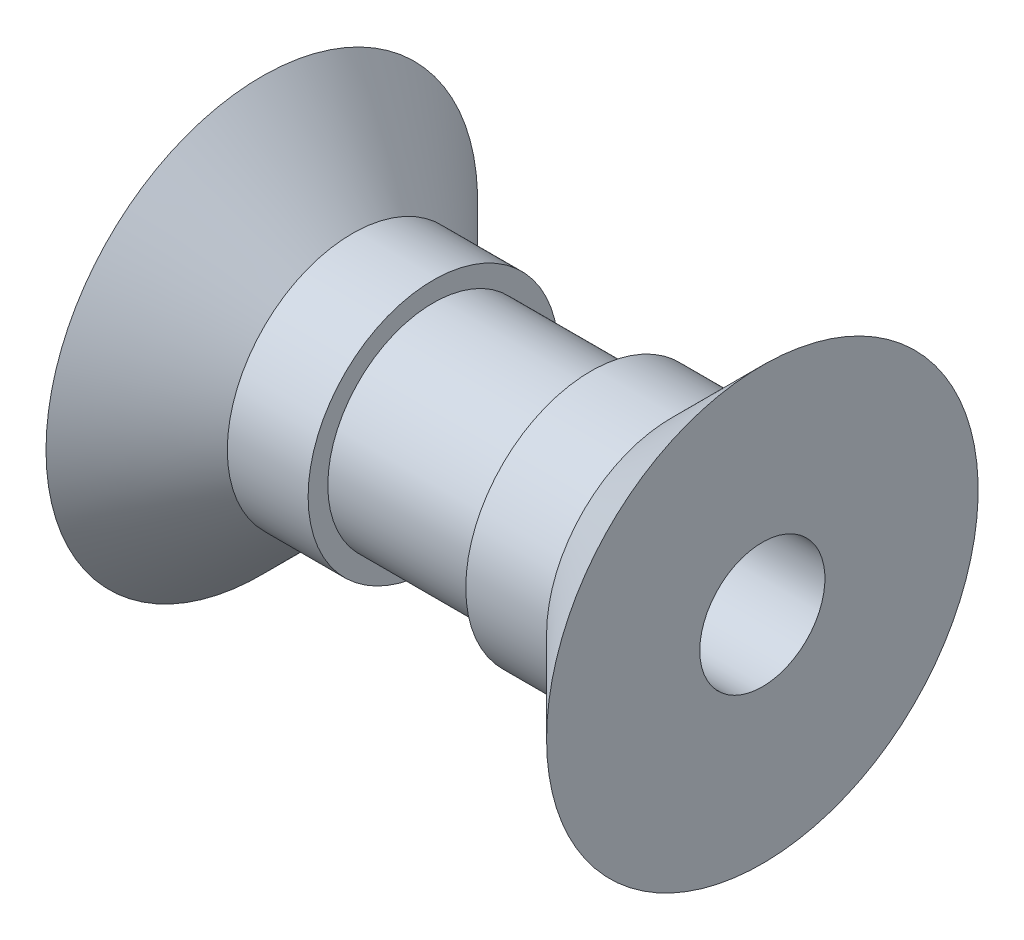
ISO-10303-21;
HEADER;
FILE_DESCRIPTION(('STEP AP214'),'2;1');
FILE_NAME('part.step','',(''),(''),'','','');
FILE_SCHEMA(('AUTOMOTIVE_DESIGN { 1 0 10303 214 1 1 1 1 }'));
ENDSEC;
DATA;
#1=APPLICATION_CONTEXT('core data for automotive mechanical design processes');
#2=APPLICATION_PROTOCOL_DEFINITION('international standard','automotive_design',2000,#1);
#3=PRODUCT_CONTEXT('',#1,'mechanical');
#4=PRODUCT('Part','Part','',(#3));
#5=PRODUCT_RELATED_PRODUCT_CATEGORY('part','',(#4));
#6=PRODUCT_DEFINITION_FORMATION('','',#4);
#7=PRODUCT_DEFINITION_CONTEXT('part definition',#1,'design');
#8=PRODUCT_DEFINITION('design','',#6,#7);
#9=PRODUCT_DEFINITION_SHAPE('','',#8);
#10=(LENGTH_UNIT() NAMED_UNIT(*) SI_UNIT(.MILLI.,.METRE.));
#11=(NAMED_UNIT(*) PLANE_ANGLE_UNIT() SI_UNIT($,.RADIAN.));
#12=(NAMED_UNIT(*) SI_UNIT($,.STERADIAN.) SOLID_ANGLE_UNIT());
#13=UNCERTAINTY_MEASURE_WITH_UNIT(LENGTH_MEASURE(1.E-05),#10,'distance_accuracy_value','');
#14=(GEOMETRIC_REPRESENTATION_CONTEXT(3) GLOBAL_UNCERTAINTY_ASSIGNED_CONTEXT((#13)) GLOBAL_UNIT_ASSIGNED_CONTEXT((#10,
#11,#12)) REPRESENTATION_CONTEXT('',''));
#15=CARTESIAN_POINT('',(0.,0.,0.));
#16=DIRECTION('',(0.,0.,1.));
#17=DIRECTION('',(1.,0.,0.));
#18=AXIS2_PLACEMENT_3D('',#15,#16,#17);
#19=CARTESIAN_POINT('',(6.35,0.,0.));
#20=DIRECTION('',(-1.,0.,0.));
#21=DIRECTION('',(0.,0.,1.));
#22=AXIS2_PLACEMENT_3D('',#19,#20,#21);
#23=PLANE('',#22);
#24=CARTESIAN_POINT('',(6.35,0.,0.));
#25=DIRECTION('',(-1.,0.,0.));
#26=DIRECTION('',(0.,0.,1.));
#27=AXIS2_PLACEMENT_3D('',#24,#25,#26);
#28=CIRCLE('',#27,1.5875);
#29=CARTESIAN_POINT('',(6.35,0.,1.5875));
#30=VERTEX_POINT('',#29);
#31=EDGE_CURVE('E61',#30,#30,#28,.T.);
#32=ORIENTED_EDGE('',*,*,#31,.T.);
#33=EDGE_LOOP('',(#32));
#34=FACE_BOUND('',#33,.T.);
#35=CARTESIAN_POINT('',(6.34999999999999,0.,0.));
#36=DIRECTION('',(-1.,0.,0.));
#37=DIRECTION('',(0.,0.,1.));
#38=AXIS2_PLACEMENT_3D('',#35,#36,#37);
#39=CIRCLE('',#38,5.47500000000001);
#40=CARTESIAN_POINT('',(6.34999999999999,0.,5.47500000000001));
#41=VERTEX_POINT('',#40);
#42=EDGE_CURVE('E10',#41,#41,#39,.T.);
#43=ORIENTED_EDGE('',*,*,#42,.F.);
#44=EDGE_LOOP('',(#43));
#45=FACE_BOUND('',#44,.T.);
#46=ADVANCED_FACE('F30',(#34,#45),#23,.F.);
#47=CARTESIAN_POINT('',(6.34999999999999,0.,0.));
#48=DIRECTION('',(1.,0.,0.));
#49=DIRECTION('',(0.,0.,-1.));
#50=AXIS2_PLACEMENT_3D('',#47,#48,#49);
#51=CONICAL_SURFACE('',#50,5.47500000000001,0.785398163397452);
#52=CARTESIAN_POINT('',(4.05,0.,0.));
#53=DIRECTION('',(-1.,0.,0.));
#54=DIRECTION('',(0.,0.,1.));
#55=AXIS2_PLACEMENT_3D('',#52,#53,#54);
#56=CIRCLE('',#55,3.175);
#57=CARTESIAN_POINT('',(4.05,0.,3.175));
#58=VERTEX_POINT('',#57);
#59=EDGE_CURVE('E36',#58,#58,#56,.T.);
#60=ORIENTED_EDGE('',*,*,#59,.F.);
#61=EDGE_LOOP('',(#60));
#62=FACE_BOUND('',#61,.T.);
#63=ORIENTED_EDGE('',*,*,#42,.T.);
#64=EDGE_LOOP('',(#63));
#65=FACE_BOUND('',#64,.T.);
#66=ADVANCED_FACE('F114',(#62,#65),#51,.T.);
#67=CARTESIAN_POINT('',(-93.9518129632939,0.,0.));
#68=DIRECTION('',(-1.,0.,0.));
#69=DIRECTION('',(0.,0.,1.));
#70=AXIS2_PLACEMENT_3D('',#67,#68,#69);
#71=CYLINDRICAL_SURFACE('',#70,3.175);
#72=CARTESIAN_POINT('',(2.,0.,0.));
#73=DIRECTION('',(-1.,0.,0.));
#74=DIRECTION('',(0.,0.,1.));
#75=AXIS2_PLACEMENT_3D('',#72,#73,#74);
#76=CIRCLE('',#75,3.175);
#77=CARTESIAN_POINT('',(2.,0.,3.175));
#78=VERTEX_POINT('',#77);
#79=EDGE_CURVE('E40',#78,#78,#76,.T.);
#80=ORIENTED_EDGE('',*,*,#79,.F.);
#81=EDGE_LOOP('',(#80));
#82=FACE_BOUND('',#81,.T.);
#83=ORIENTED_EDGE('',*,*,#59,.T.);
#84=EDGE_LOOP('',(#83));
#85=FACE_BOUND('',#84,.T.);
#86=ADVANCED_FACE('F109',(#82,#85),#71,.T.);
#87=CARTESIAN_POINT('',(2.,3.175,0.));
#88=DIRECTION('',(1.,0.,0.));
#89=DIRECTION('',(0.,0.,-1.));
#90=AXIS2_PLACEMENT_3D('',#87,#88,#89);
#91=PLANE('',#90);
#92=CARTESIAN_POINT('',(2.,0.,0.));
#93=DIRECTION('',(-1.,0.,0.));
#94=DIRECTION('',(0.,0.,1.));
#95=AXIS2_PLACEMENT_3D('',#92,#93,#94);
#96=CIRCLE('',#95,2.675);
#97=CARTESIAN_POINT('',(2.,0.,2.675));
#98=VERTEX_POINT('',#97);
#99=EDGE_CURVE('E44',#98,#98,#96,.T.);
#100=ORIENTED_EDGE('',*,*,#99,.F.);
#101=EDGE_LOOP('',(#100));
#102=FACE_BOUND('',#101,.T.);
#103=ORIENTED_EDGE('',*,*,#79,.T.);
#104=EDGE_LOOP('',(#103));
#105=FACE_BOUND('',#104,.T.);
#106=ADVANCED_FACE('F103',(#102,#105),#91,.F.);
#107=CARTESIAN_POINT('',(-93.9518129632939,0.,0.));
#108=DIRECTION('',(-1.,0.,0.));
#109=DIRECTION('',(0.,0.,1.));
#110=AXIS2_PLACEMENT_3D('',#107,#108,#109);
#111=CYLINDRICAL_SURFACE('',#110,2.675);
#112=CARTESIAN_POINT('',(-2.,0.,0.));
#113=DIRECTION('',(-1.,0.,0.));
#114=DIRECTION('',(0.,0.,1.));
#115=AXIS2_PLACEMENT_3D('',#112,#113,#114);
#116=CIRCLE('',#115,2.675);
#117=CARTESIAN_POINT('',(-2.,0.,2.675));
#118=VERTEX_POINT('',#117);
#119=EDGE_CURVE('E49',#118,#118,#116,.T.);
#120=ORIENTED_EDGE('',*,*,#119,.F.);
#121=EDGE_LOOP('',(#120));
#122=FACE_BOUND('',#121,.T.);
#123=ORIENTED_EDGE('',*,*,#99,.T.);
#124=EDGE_LOOP('',(#123));
#125=FACE_BOUND('',#124,.T.);
#126=ADVANCED_FACE('F97',(#122,#125),#111,.T.);
#127=CARTESIAN_POINT('',(-2.,3.175,0.));
#128=DIRECTION('',(-1.,0.,0.));
#129=DIRECTION('',(0.,0.,1.));
#130=AXIS2_PLACEMENT_3D('',#127,#128,#129);
#131=PLANE('',#130);
#132=CARTESIAN_POINT('',(-2.,0.,0.));
#133=DIRECTION('',(-1.,0.,0.));
#134=DIRECTION('',(0.,0.,1.));
#135=AXIS2_PLACEMENT_3D('',#132,#133,#134);
#136=CIRCLE('',#135,3.175);
#137=CARTESIAN_POINT('',(-2.,0.,3.175));
#138=VERTEX_POINT('',#137);
#139=EDGE_CURVE('E52',#138,#138,#136,.T.);
#140=ORIENTED_EDGE('',*,*,#139,.F.);
#141=EDGE_LOOP('',(#140));
#142=FACE_BOUND('',#141,.T.);
#143=ORIENTED_EDGE('',*,*,#119,.T.);
#144=EDGE_LOOP('',(#143));
#145=FACE_BOUND('',#144,.T.);
#146=ADVANCED_FACE('F91',(#142,#145),#131,.F.);
#147=CARTESIAN_POINT('',(-93.9518129632939,0.,0.));
#148=DIRECTION('',(-1.,0.,0.));
#149=DIRECTION('',(0.,0.,1.));
#150=AXIS2_PLACEMENT_3D('',#147,#148,#149);
#151=CYLINDRICAL_SURFACE('',#150,3.175);
#152=CARTESIAN_POINT('',(-4.05,0.,0.));
#153=DIRECTION('',(-1.,0.,0.));
#154=DIRECTION('',(0.,0.,1.));
#155=AXIS2_PLACEMENT_3D('',#152,#153,#154);
#156=CIRCLE('',#155,3.175);
#157=CARTESIAN_POINT('',(-4.05,0.,3.175));
#158=VERTEX_POINT('',#157);
#159=EDGE_CURVE('E55',#158,#158,#156,.T.);
#160=ORIENTED_EDGE('',*,*,#159,.F.);
#161=EDGE_LOOP('',(#160));
#162=FACE_BOUND('',#161,.T.);
#163=ORIENTED_EDGE('',*,*,#139,.T.);
#164=EDGE_LOOP('',(#163));
#165=FACE_BOUND('',#164,.T.);
#166=ADVANCED_FACE('F85',(#162,#165),#151,.T.);
#167=CARTESIAN_POINT('',(-4.05,0.,0.));
#168=DIRECTION('',(-1.,0.,0.));
#169=DIRECTION('',(0.,0.,1.));
#170=AXIS2_PLACEMENT_3D('',#167,#168,#169);
#171=CONICAL_SURFACE('',#170,3.175,0.785398163397452);
#172=CARTESIAN_POINT('',(-6.34999999999999,0.,0.));
#173=DIRECTION('',(-1.,0.,0.));
#174=DIRECTION('',(0.,0.,1.));
#175=AXIS2_PLACEMENT_3D('',#172,#173,#174);
#176=CIRCLE('',#175,5.47500000000001);
#177=CARTESIAN_POINT('',(-6.34999999999999,0.,5.47500000000001));
#178=VERTEX_POINT('',#177);
#179=EDGE_CURVE('E58',#178,#178,#176,.T.);
#180=ORIENTED_EDGE('',*,*,#179,.F.);
#181=EDGE_LOOP('',(#180));
#182=FACE_BOUND('',#181,.T.);
#183=ORIENTED_EDGE('',*,*,#159,.T.);
#184=EDGE_LOOP('',(#183));
#185=FACE_BOUND('',#184,.T.);
#186=ADVANCED_FACE('F79',(#182,#185),#171,.T.);
#187=CARTESIAN_POINT('',(-6.35,0.,0.));
#188=DIRECTION('',(1.,0.,0.));
#189=DIRECTION('',(0.,0.,-1.));
#190=AXIS2_PLACEMENT_3D('',#187,#188,#189);
#191=PLANE('',#190);
#192=CARTESIAN_POINT('',(-6.35,0.,0.));
#193=DIRECTION('',(-1.,0.,0.));
#194=DIRECTION('',(0.,0.,1.));
#195=AXIS2_PLACEMENT_3D('',#192,#193,#194);
#196=CIRCLE('',#195,1.5875);
#197=CARTESIAN_POINT('',(-6.35,0.,1.5875));
#198=VERTEX_POINT('',#197);
#199=EDGE_CURVE('E62',#198,#198,#196,.T.);
#200=ORIENTED_EDGE('',*,*,#199,.F.);
#201=EDGE_LOOP('',(#200));
#202=FACE_BOUND('',#201,.T.);
#203=ORIENTED_EDGE('',*,*,#179,.T.);
#204=EDGE_LOOP('',(#203));
#205=FACE_BOUND('',#204,.T.);
#206=ADVANCED_FACE('F73',(#202,#205),#191,.F.);
#207=CARTESIAN_POINT('',(6.35,0.,0.));
#208=DIRECTION('',(-1.,0.,0.));
#209=DIRECTION('',(0.,0.,1.));
#210=AXIS2_PLACEMENT_3D('',#207,#208,#209);
#211=CYLINDRICAL_SURFACE('',#210,1.5875);
#212=ORIENTED_EDGE('',*,*,#31,.F.);
#213=EDGE_LOOP('',(#212));
#214=FACE_BOUND('',#213,.T.);
#215=ORIENTED_EDGE('',*,*,#199,.T.);
#216=EDGE_LOOP('',(#215));
#217=FACE_BOUND('',#216,.T.);
#218=ADVANCED_FACE('F70',(#214,#217),#211,.F.);
#219=CLOSED_SHELL('',(#46,#66,#86,#106,#126,#146,#166,#186,#206,#218));
#220=MANIFOLD_SOLID_BREP('B2',#219);
#221=ADVANCED_BREP_SHAPE_REPRESENTATION('',(#18,#220),#14);
#222=SHAPE_DEFINITION_REPRESENTATION(#9,#221);
ENDSEC;
END-ISO-10303-21;
